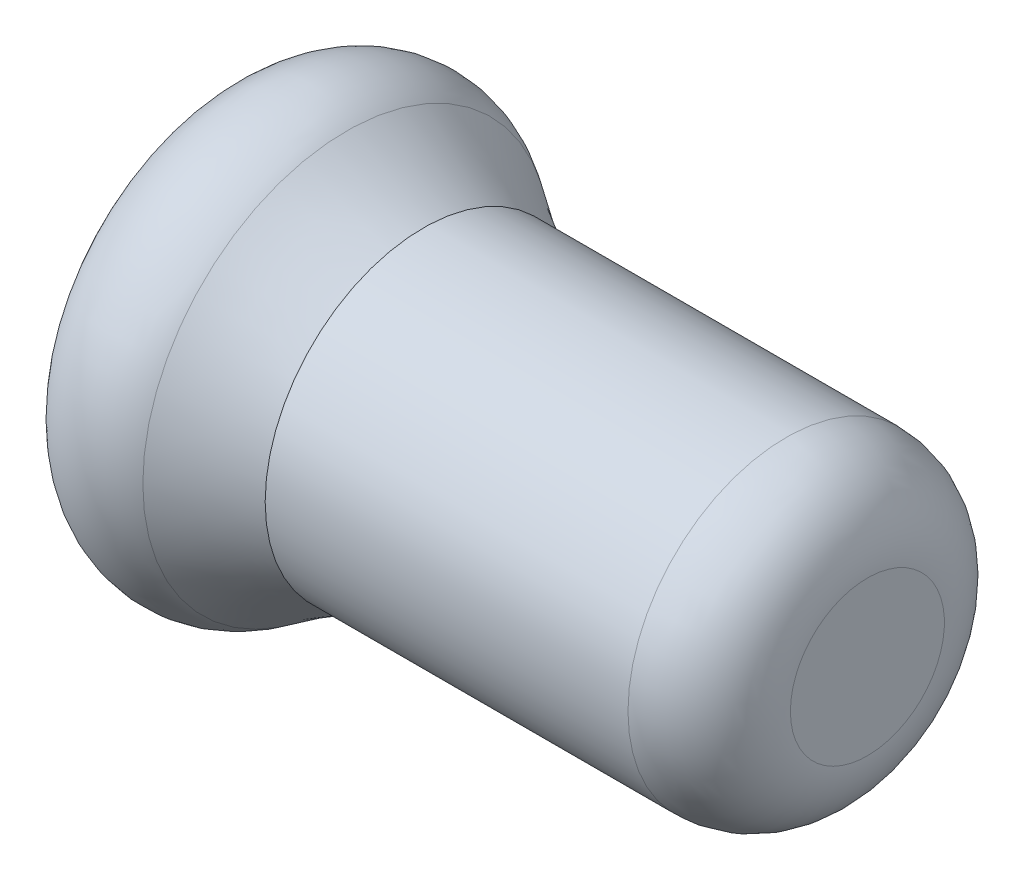
ISO-10303-21;
HEADER;
FILE_DESCRIPTION(('STEP AP214'),'2;1');
FILE_NAME('part.step','',(''),(''),'','','');
FILE_SCHEMA(('AUTOMOTIVE_DESIGN { 1 0 10303 214 1 1 1 1 }'));
ENDSEC;
DATA;
#1=APPLICATION_CONTEXT('core data for automotive mechanical design processes');
#2=APPLICATION_PROTOCOL_DEFINITION('international standard','automotive_design',2000,#1);
#3=PRODUCT_CONTEXT('',#1,'mechanical');
#4=PRODUCT('Part','Part','',(#3));
#5=PRODUCT_RELATED_PRODUCT_CATEGORY('part','',(#4));
#6=PRODUCT_DEFINITION_FORMATION('','',#4);
#7=PRODUCT_DEFINITION_CONTEXT('part definition',#1,'design');
#8=PRODUCT_DEFINITION('design','',#6,#7);
#9=PRODUCT_DEFINITION_SHAPE('','',#8);
#10=(LENGTH_UNIT() NAMED_UNIT(*) SI_UNIT(.MILLI.,.METRE.));
#11=(NAMED_UNIT(*) PLANE_ANGLE_UNIT() SI_UNIT($,.RADIAN.));
#12=(NAMED_UNIT(*) SI_UNIT($,.STERADIAN.) SOLID_ANGLE_UNIT());
#13=UNCERTAINTY_MEASURE_WITH_UNIT(LENGTH_MEASURE(1.E-05),#10,'distance_accuracy_value','');
#14=(GEOMETRIC_REPRESENTATION_CONTEXT(3) GLOBAL_UNCERTAINTY_ASSIGNED_CONTEXT((#13)) GLOBAL_UNIT_ASSIGNED_CONTEXT((#10,
#11,#12)) REPRESENTATION_CONTEXT('',''));
#15=CARTESIAN_POINT('',(0.,0.,0.));
#16=DIRECTION('',(0.,0.,1.));
#17=DIRECTION('',(1.,0.,0.));
#18=AXIS2_PLACEMENT_3D('',#15,#16,#17);
#19=CARTESIAN_POINT('',(-13.2942968783673,0.,0.));
#20=DIRECTION('',(1.,0.,0.));
#21=DIRECTION('',(0.,0.,-1.));
#22=AXIS2_PLACEMENT_3D('',#19,#20,#21);
#23=CONICAL_SURFACE('',#22,8.99995169971466,1.56694124642419);
#24=CARTESIAN_POINT('',(-13.3193548387097,0.,0.));
#25=DIRECTION('',(-1.,0.,0.));
#26=DIRECTION('',(0.,0.,1.));
#27=AXIS2_PLACEMENT_3D('',#24,#25,#26);
#28=CIRCLE('',#27,2.5);
#29=CARTESIAN_POINT('',(-13.3193548387097,0.,2.5));
#30=VERTEX_POINT('',#29);
#31=EDGE_CURVE('E61',#30,#30,#28,.T.);
#32=ORIENTED_EDGE('',*,*,#31,.F.);
#33=EDGE_LOOP('',(#32));
#34=FACE_BOUND('',#33,.T.);
#35=CARTESIAN_POINT('',(-13.2942968783673,0.,0.));
#36=DIRECTION('',(-1.,0.,0.));
#37=DIRECTION('',(0.,0.,1.));
#38=AXIS2_PLACEMENT_3D('',#35,#36,#37);
#39=CIRCLE('',#38,8.99995169971466);
#40=CARTESIAN_POINT('',(-13.2942968783673,0.,8.99995169971466));
#41=VERTEX_POINT('',#40);
#42=EDGE_CURVE('E10',#41,#41,#39,.T.);
#43=ORIENTED_EDGE('',*,*,#42,.T.);
#44=EDGE_LOOP('',(#43));
#45=FACE_BOUND('',#44,.T.);
#46=ADVANCED_FACE('F36',(#34,#45),#23,.T.);
#47=CARTESIAN_POINT('',(-8.31935483870968,0.,0.));
#48=DIRECTION('',(-1.,0.,0.));
#49=DIRECTION('',(0.,0.,1.));
#50=AXIS2_PLACEMENT_3D('',#47,#48,#49);
#51=TOROIDAL_SURFACE('',#50,8.5,5.);
#52=ORIENTED_EDGE('',*,*,#42,.F.);
#53=EDGE_LOOP('',(#52));
#54=FACE_BOUND('',#53,.T.);
#55=CARTESIAN_POINT('',(-5.38347673379737,0.,0.));
#56=DIRECTION('',(-1.,0.,0.));
#57=DIRECTION('',(0.,0.,1.));
#58=AXIS2_PLACEMENT_3D('',#55,#56,#57);
#59=CIRCLE('',#58,12.5472978335053);
#60=CARTESIAN_POINT('',(-5.38347673379737,0.,12.5472978335053));
#61=VERTEX_POINT('',#60);
#62=EDGE_CURVE('E42',#61,#61,#59,.T.);
#63=ORIENTED_EDGE('',*,*,#62,.T.);
#64=EDGE_LOOP('',(#63));
#65=FACE_BOUND('',#64,.T.);
#66=ADVANCED_FACE('F68',(#54,#65),#51,.T.);
#67=CARTESIAN_POINT('',(12.2317918956764,0.,0.));
#68=DIRECTION('',(-1.,0.,0.));
#69=DIRECTION('',(0.,0.,1.));
#70=AXIS2_PLACEMENT_3D('',#67,#68,#69);
#71=TOROIDAL_SURFACE('',#70,36.831084834537,30.);
#72=ORIENTED_EDGE('',*,*,#62,.F.);
#73=EDGE_LOOP('',(#72));
#74=FACE_BOUND('',#73,.T.);
#75=CARTESIAN_POINT('',(-0.656411636391177,0.,0.));
#76=DIRECTION('',(-1.,0.,0.));
#77=DIRECTION('',(0.,0.,1.));
#78=AXIS2_PLACEMENT_3D('',#75,#76,#77);
#79=CIRCLE('',#78,9.74060293192032);
#80=CARTESIAN_POINT('',(-0.656411636391177,0.,9.74060293192032));
#81=VERTEX_POINT('',#80);
#82=EDGE_CURVE('E46',#81,#81,#79,.T.);
#83=ORIENTED_EDGE('',*,*,#82,.T.);
#84=EDGE_LOOP('',(#83));
#85=FACE_BOUND('',#84,.T.);
#86=ADVANCED_FACE('F72',(#74,#85),#71,.F.);
#87=CARTESIAN_POINT('',(-16.0091654714961,0.,0.));
#88=DIRECTION('',(-1.,0.,0.));
#89=DIRECTION('',(0.,0.,1.));
#90=AXIS2_PLACEMENT_3D('',#87,#88,#89);
#91=CYLINDRICAL_SURFACE('',#90,9.74060293192032);
#92=ORIENTED_EDGE('',*,*,#82,.F.);
#93=EDGE_LOOP('',(#92));
#94=FACE_BOUND('',#93,.T.);
#95=CARTESIAN_POINT('',(21.6806451612903,0.,0.));
#96=DIRECTION('',(-1.,0.,0.));
#97=DIRECTION('',(0.,0.,1.));
#98=AXIS2_PLACEMENT_3D('',#95,#96,#97);
#99=CIRCLE('',#98,9.74060293192032);
#100=CARTESIAN_POINT('',(21.6806451612903,0.,9.74060293192032));
#101=VERTEX_POINT('',#100);
#102=EDGE_CURVE('E50',#101,#101,#99,.T.);
#103=ORIENTED_EDGE('',*,*,#102,.T.);
#104=EDGE_LOOP('',(#103));
#105=FACE_BOUND('',#104,.T.);
#106=ADVANCED_FACE('F77',(#94,#105),#91,.T.);
#107=CARTESIAN_POINT('',(21.6806451612903,0.,0.));
#108=DIRECTION('',(-1.,0.,0.));
#109=DIRECTION('',(0.,0.,1.));
#110=AXIS2_PLACEMENT_3D('',#107,#108,#109);
#111=DEGENERATE_TOROIDAL_SURFACE('',#110,4.74060293192032,5.,.T.);
#112=ORIENTED_EDGE('',*,*,#102,.F.);
#113=EDGE_LOOP('',(#112));
#114=FACE_BOUND('',#113,.T.);
#115=CARTESIAN_POINT('',(26.6806451612903,0.,0.));
#116=DIRECTION('',(-1.,0.,0.));
#117=DIRECTION('',(0.,0.,1.));
#118=AXIS2_PLACEMENT_3D('',#115,#116,#117);
#119=CIRCLE('',#118,4.74060293192032);
#120=CARTESIAN_POINT('',(26.6806451612903,0.,4.74060293192032));
#121=VERTEX_POINT('',#120);
#122=EDGE_CURVE('E55',#121,#121,#119,.T.);
#123=ORIENTED_EDGE('',*,*,#122,.T.);
#124=EDGE_LOOP('',(#123));
#125=FACE_BOUND('',#124,.T.);
#126=ADVANCED_FACE('F83',(#114,#125),#111,.T.);
#127=CARTESIAN_POINT('',(26.6806451612903,2.,0.));
#128=DIRECTION('',(-1.,0.,0.));
#129=DIRECTION('',(0.,0.,1.));
#130=AXIS2_PLACEMENT_3D('',#127,#128,#129);
#131=PLANE('',#130);
#132=ORIENTED_EDGE('',*,*,#122,.F.);
#133=EDGE_LOOP('',(#132));
#134=FACE_BOUND('',#133,.T.);
#135=ADVANCED_FACE('F87',(#134),#131,.F.);
#136=CARTESIAN_POINT('',(21.6806451612903,0.,0.));
#137=DIRECTION('',(1.,0.,0.));
#138=DIRECTION('',(0.,0.,-1.));
#139=AXIS2_PLACEMENT_3D('',#136,#137,#138);
#140=PLANE('',#139);
#141=CARTESIAN_POINT('',(21.6806451612903,0.,0.));
#142=DIRECTION('',(-1.,0.,0.));
#143=DIRECTION('',(0.,0.,1.));
#144=AXIS2_PLACEMENT_3D('',#141,#142,#143);
#145=CIRCLE('',#144,2.5);
#146=CARTESIAN_POINT('',(21.6806451612903,0.,2.5));
#147=VERTEX_POINT('',#146);
#148=EDGE_CURVE('E58',#147,#147,#145,.T.);
#149=ORIENTED_EDGE('',*,*,#148,.T.);
#150=EDGE_LOOP('',(#149));
#151=FACE_BOUND('',#150,.T.);
#152=ADVANCED_FACE('F91',(#151),#140,.F.);
#153=CARTESIAN_POINT('',(-16.0091654714961,0.,0.));
#154=DIRECTION('',(-1.,0.,0.));
#155=DIRECTION('',(0.,0.,1.));
#156=AXIS2_PLACEMENT_3D('',#153,#154,#155);
#157=CYLINDRICAL_SURFACE('',#156,2.5);
#158=ORIENTED_EDGE('',*,*,#148,.F.);
#159=EDGE_LOOP('',(#158));
#160=FACE_BOUND('',#159,.T.);
#161=ORIENTED_EDGE('',*,*,#31,.T.);
#162=EDGE_LOOP('',(#161));
#163=FACE_BOUND('',#162,.T.);
#164=ADVANCED_FACE('F65',(#160,#163),#157,.F.);
#165=CLOSED_SHELL('',(#46,#66,#86,#106,#126,#135,#152,#164));
#166=MANIFOLD_SOLID_BREP('B2',#165);
#167=ADVANCED_BREP_SHAPE_REPRESENTATION('',(#18,#166),#14);
#168=SHAPE_DEFINITION_REPRESENTATION(#9,#167);
ENDSEC;
END-ISO-10303-21;
